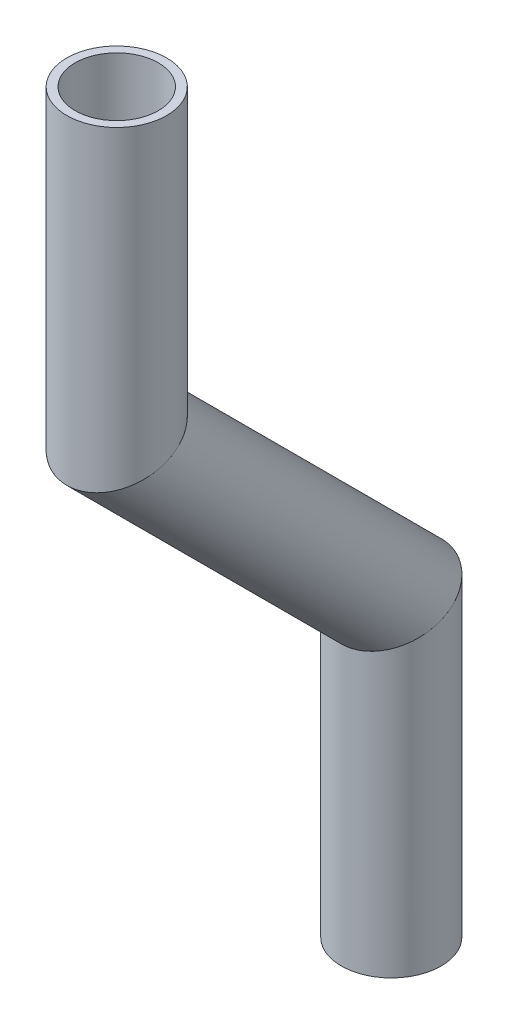
ISO-10303-21;
HEADER;
FILE_DESCRIPTION(('STEP AP214'),'2;1');
FILE_NAME('part.step','',(''),(''),'','','');
FILE_SCHEMA(('AUTOMOTIVE_DESIGN { 1 0 10303 214 1 1 1 1 }'));
ENDSEC;
DATA;
#1=APPLICATION_CONTEXT('core data for automotive mechanical design processes');
#2=APPLICATION_PROTOCOL_DEFINITION('international standard','automotive_design',2000,#1);
#3=PRODUCT_CONTEXT('',#1,'mechanical');
#4=PRODUCT('Part','Part','',(#3));
#5=PRODUCT_RELATED_PRODUCT_CATEGORY('part','',(#4));
#6=PRODUCT_DEFINITION_FORMATION('','',#4);
#7=PRODUCT_DEFINITION_CONTEXT('part definition',#1,'design');
#8=PRODUCT_DEFINITION('design','',#6,#7);
#9=PRODUCT_DEFINITION_SHAPE('','',#8);
#10=(LENGTH_UNIT() NAMED_UNIT(*) SI_UNIT(.MILLI.,.METRE.));
#11=(NAMED_UNIT(*) PLANE_ANGLE_UNIT() SI_UNIT($,.RADIAN.));
#12=(NAMED_UNIT(*) SI_UNIT($,.STERADIAN.) SOLID_ANGLE_UNIT());
#13=UNCERTAINTY_MEASURE_WITH_UNIT(LENGTH_MEASURE(1.E-05),#10,'distance_accuracy_value','');
#14=(GEOMETRIC_REPRESENTATION_CONTEXT(3) GLOBAL_UNCERTAINTY_ASSIGNED_CONTEXT((#13)) GLOBAL_UNIT_ASSIGNED_CONTEXT((#10,
#11,#12)) REPRESENTATION_CONTEXT('',''));
#15=CARTESIAN_POINT('',(0.,0.,0.));
#16=DIRECTION('',(0.,0.,1.));
#17=DIRECTION('',(1.,0.,0.));
#18=AXIS2_PLACEMENT_3D('',#15,#16,#17);
#19=CARTESIAN_POINT('',(0.,-473.44106483783,362.765281468091));
#20=DIRECTION('',(0.,1.,0.));
#21=DIRECTION('',(0.,0.,1.));
#22=AXIS2_PLACEMENT_3D('',#19,#20,#21);
#23=CYLINDRICAL_SURFACE('',#22,5.28319999999999);
#24=CARTESIAN_POINT('',(0.,-435.34106483783,362.765281468092));
#25=DIRECTION('',(0.,-1.,0.));
#26=DIRECTION('',(0.,0.,-1.));
#27=AXIS2_PLACEMENT_3D('',#24,#25,#26);
#28=CIRCLE('',#27,5.28319999999999);
#29=CARTESIAN_POINT('',(0.,-435.34106483783,357.482081468092));
#30=VERTEX_POINT('',#29);
#31=EDGE_CURVE('E68',#30,#30,#28,.T.);
#32=ORIENTED_EDGE('',*,*,#31,.F.);
#33=EDGE_LOOP('',(#32));
#34=FACE_BOUND('',#33,.T.);
#35=CARTESIAN_POINT('',(0.,-473.44106483783,362.765281468091));
#36=DIRECTION('',(0.,-0.923879532511285,-0.382683432365094));
#37=DIRECTION('',(0.,0.382683432365094,-0.923879532511285));
#38=AXIS2_PLACEMENT_3D('',#35,#36,#37);
#39=ELLIPSE('',#38,5.71849447258476,5.28319999999999);
#40=CARTESIAN_POINT('',(0.,-471.2526917451,357.482081468091));
#41=VERTEX_POINT('',#40);
#42=EDGE_CURVE('E64',#41,#41,#39,.T.);
#43=ORIENTED_EDGE('',*,*,#42,.T.);
#44=EDGE_LOOP('',(#43));
#45=FACE_BOUND('',#44,.T.);
#46=ADVANCED_FACE('F60',(#34,#45),#23,.F.);
#47=CARTESIAN_POINT('',(0.,-473.44106483783,362.765281468091));
#48=DIRECTION('',(0.,1.,0.));
#49=DIRECTION('',(0.,0.,1.));
#50=AXIS2_PLACEMENT_3D('',#47,#48,#49);
#51=CYLINDRICAL_SURFACE('',#50,6.35);
#52=CARTESIAN_POINT('',(0.,-435.34106483783,362.765281468092));
#53=DIRECTION('',(0.,-1.,0.));
#54=DIRECTION('',(0.,0.,-1.));
#55=AXIS2_PLACEMENT_3D('',#52,#53,#54);
#56=CIRCLE('',#55,6.35);
#57=CARTESIAN_POINT('',(0.,-435.34106483783,356.415281468092));
#58=VERTEX_POINT('',#57);
#59=EDGE_CURVE('E72',#58,#58,#56,.T.);
#60=ORIENTED_EDGE('',*,*,#59,.T.);
#61=EDGE_LOOP('',(#60));
#62=FACE_BOUND('',#61,.T.);
#63=CARTESIAN_POINT('',(0.,-473.44106483783,362.765281468091));
#64=DIRECTION('',(0.,-0.923879532511285,-0.382683432365094));
#65=DIRECTION('',(0.,0.382683432365094,-0.923879532511285));
#66=AXIS2_PLACEMENT_3D('',#63,#64,#65);
#67=ELLIPSE('',#66,6.8731904718567,6.35);
#68=CARTESIAN_POINT('',(0.,-470.810808716761,356.415281468091));
#69=VERTEX_POINT('',#68);
#70=EDGE_CURVE('E14',#69,#69,#67,.T.);
#71=ORIENTED_EDGE('',*,*,#70,.F.);
#72=EDGE_LOOP('',(#71));
#73=FACE_BOUND('',#72,.T.);
#74=ADVANCED_FACE('F87',(#62,#73),#51,.T.);
#75=CARTESIAN_POINT('',(0.,-435.34106483783,362.765281468092));
#76=DIRECTION('',(0.,-1.,0.));
#77=DIRECTION('',(0.,0.,-1.));
#78=AXIS2_PLACEMENT_3D('',#75,#76,#77);
#79=PLANE('',#78);
#80=ORIENTED_EDGE('',*,*,#31,.T.);
#81=EDGE_LOOP('',(#80));
#82=FACE_BOUND('',#81,.T.);
#83=ORIENTED_EDGE('',*,*,#59,.F.);
#84=EDGE_LOOP('',(#83));
#85=FACE_BOUND('',#84,.T.);
#86=ADVANCED_FACE('F83',(#82,#85),#79,.F.);
#87=CARTESIAN_POINT('',(0.,-473.44106483783,362.765281468091));
#88=DIRECTION('',(0.,-0.923879532511285,-0.382683432365094));
#89=DIRECTION('',(0.,0.382683432365094,-0.923879532511285));
#90=AXIS2_PLACEMENT_3D('',#87,#88,#89);
#91=PLANE('',#90);
#92=ORIENTED_EDGE('',*,*,#42,.F.);
#93=EDGE_LOOP('',(#92));
#94=FACE_BOUND('',#93,.T.);
#95=ORIENTED_EDGE('',*,*,#70,.T.);
#96=EDGE_LOOP('',(#95));
#97=FACE_BOUND('',#96,.T.);
#98=ADVANCED_FACE('F62',(#94,#97),#91,.T.);
#99=CLOSED_SHELL('',(#46,#74,#86,#98));
#100=MANIFOLD_SOLID_BREP('B2',#99);
#101=CARTESIAN_POINT('',(0.,-508.351753076972,327.854593228949));
#102=DIRECTION('',(0.,0.707106781186545,0.70710678118655));
#103=DIRECTION('',(0.,-0.70710678118655,0.707106781186545));
#104=AXIS2_PLACEMENT_3D('',#101,#102,#103);
#105=CYLINDRICAL_SURFACE('',#104,5.28319999999999);
#106=CARTESIAN_POINT('',(0.,-508.351753076972,327.854593228949));
#107=DIRECTION('',(0.,-0.923879532511285,-0.382683432365094));
#108=DIRECTION('',(0.,-0.382683432365094,0.923879532511285));
#109=AXIS2_PLACEMENT_3D('',#106,#107,#108);
#110=ELLIPSE('',#109,5.71849447258476,5.28319999999999);
#111=CARTESIAN_POINT('',(0.,-510.540126169702,333.137793228949));
#112=VERTEX_POINT('',#111);
#113=EDGE_CURVE('E167',#112,#112,#110,.T.);
#114=ORIENTED_EDGE('',*,*,#113,.T.);
#115=EDGE_LOOP('',(#114));
#116=FACE_BOUND('',#115,.T.);
#117=CARTESIAN_POINT('',(0.,-473.44106483783,362.765281468091));
#118=DIRECTION('',(0.,0.923879532511285,0.382683432365094));
#119=DIRECTION('',(0.,-0.382683432365094,0.923879532511285));
#120=AXIS2_PLACEMENT_3D('',#117,#118,#119);
#121=ELLIPSE('',#120,5.71849447258476,5.28319999999999);
#122=CARTESIAN_POINT('',(0.,-475.629437930559,368.048481468091));
#123=VERTEX_POINT('',#122);
#124=EDGE_CURVE('E157',#123,#123,#121,.T.);
#125=ORIENTED_EDGE('',*,*,#124,.T.);
#126=EDGE_LOOP('',(#125));
#127=FACE_BOUND('',#126,.T.);
#128=ADVANCED_FACE('F153',(#116,#127),#105,.F.);
#129=CARTESIAN_POINT('',(0.,-508.351753076972,327.854593228949));
#130=DIRECTION('',(0.,0.707106781186545,0.70710678118655));
#131=DIRECTION('',(0.,-0.70710678118655,0.707106781186545));
#132=AXIS2_PLACEMENT_3D('',#129,#130,#131);
#133=CYLINDRICAL_SURFACE('',#132,6.35);
#134=CARTESIAN_POINT('',(0.,-508.351753076972,327.854593228949));
#135=DIRECTION('',(0.,-0.923879532511285,-0.382683432365094));
#136=DIRECTION('',(0.,-0.382683432365094,0.923879532511285));
#137=AXIS2_PLACEMENT_3D('',#134,#135,#136);
#138=ELLIPSE('',#137,6.8731904718567,6.35);
#139=CARTESIAN_POINT('',(0.,-510.982009198041,334.204593228949));
#140=VERTEX_POINT('',#139);
#141=EDGE_CURVE('E161',#140,#140,#138,.T.);
#142=ORIENTED_EDGE('',*,*,#141,.F.);
#143=EDGE_LOOP('',(#142));
#144=FACE_BOUND('',#143,.T.);
#145=CARTESIAN_POINT('',(0.,-473.44106483783,362.765281468091));
#146=DIRECTION('',(0.,0.923879532511285,0.382683432365094));
#147=DIRECTION('',(0.,-0.382683432365094,0.923879532511285));
#148=AXIS2_PLACEMENT_3D('',#145,#146,#147);
#149=ELLIPSE('',#148,6.8731904718567,6.35);
#150=CARTESIAN_POINT('',(0.,-476.071320958899,369.115281468091));
#151=VERTEX_POINT('',#150);
#152=EDGE_CURVE('E59',#151,#151,#149,.T.);
#153=ORIENTED_EDGE('',*,*,#152,.F.);
#154=EDGE_LOOP('',(#153));
#155=FACE_BOUND('',#154,.T.);
#156=ADVANCED_FACE('F180',(#144,#155),#133,.T.);
#157=CARTESIAN_POINT('',(0.,-508.351753076972,327.854593228949));
#158=DIRECTION('',(0.,-0.923879532511285,-0.382683432365094));
#159=DIRECTION('',(0.,0.382683432365094,-0.923879532511285));
#160=AXIS2_PLACEMENT_3D('',#157,#158,#159);
#161=PLANE('',#160);
#162=ORIENTED_EDGE('',*,*,#113,.F.);
#163=EDGE_LOOP('',(#162));
#164=FACE_BOUND('',#163,.T.);
#165=ORIENTED_EDGE('',*,*,#141,.T.);
#166=EDGE_LOOP('',(#165));
#167=FACE_BOUND('',#166,.T.);
#168=ADVANCED_FACE('F176',(#164,#167),#161,.T.);
#169=CARTESIAN_POINT('',(0.,-473.44106483783,362.765281468091));
#170=DIRECTION('',(0.,0.923879532511285,0.382683432365094));
#171=DIRECTION('',(0.,-0.382683432365094,0.923879532511285));
#172=AXIS2_PLACEMENT_3D('',#169,#170,#171);
#173=PLANE('',#172);
#174=ORIENTED_EDGE('',*,*,#124,.F.);
#175=EDGE_LOOP('',(#174));
#176=FACE_BOUND('',#175,.T.);
#177=ORIENTED_EDGE('',*,*,#152,.T.);
#178=EDGE_LOOP('',(#177));
#179=FACE_BOUND('',#178,.T.);
#180=ADVANCED_FACE('F155',(#176,#179),#173,.T.);
#181=CLOSED_SHELL('',(#128,#156,#168,#180));
#182=MANIFOLD_SOLID_BREP('B9',#181);
#183=CARTESIAN_POINT('',(0.,-546.451753076974,327.854593228946));
#184=DIRECTION('',(0.,1.,0.));
#185=DIRECTION('',(0.,0.,1.));
#186=AXIS2_PLACEMENT_3D('',#183,#184,#185);
#187=CYLINDRICAL_SURFACE('',#186,5.28319999999999);
#188=CARTESIAN_POINT('',(0.,-546.451753076974,327.854593228946));
#189=DIRECTION('',(0.,-1.,0.));
#190=DIRECTION('',(0.,0.,-1.));
#191=AXIS2_PLACEMENT_3D('',#188,#189,#190);
#192=CIRCLE('',#191,5.28319999999999);
#193=CARTESIAN_POINT('',(0.,-546.451753076974,322.571393228946));
#194=VERTEX_POINT('',#193);
#195=EDGE_CURVE('E249',#194,#194,#192,.T.);
#196=ORIENTED_EDGE('',*,*,#195,.T.);
#197=EDGE_LOOP('',(#196));
#198=FACE_BOUND('',#197,.T.);
#199=CARTESIAN_POINT('',(0.,-508.351753076971,327.854593228946));
#200=DIRECTION('',(0.,0.923879532511285,0.382683432365094));
#201=DIRECTION('',(0.,0.382683432365094,-0.923879532511285));
#202=AXIS2_PLACEMENT_3D('',#199,#200,#201);
#203=ELLIPSE('',#202,5.71849447258477,5.28319999999999);
#204=CARTESIAN_POINT('',(0.,-506.163379984242,322.571393228946));
#205=VERTEX_POINT('',#204);
#206=EDGE_CURVE('E239',#205,#205,#203,.T.);
#207=ORIENTED_EDGE('',*,*,#206,.T.);
#208=EDGE_LOOP('',(#207));
#209=FACE_BOUND('',#208,.T.);
#210=ADVANCED_FACE('F235',(#198,#209),#187,.F.);
#211=CARTESIAN_POINT('',(0.,-546.451753076974,327.854593228946));
#212=DIRECTION('',(0.,1.,0.));
#213=DIRECTION('',(0.,0.,1.));
#214=AXIS2_PLACEMENT_3D('',#211,#212,#213);
#215=CYLINDRICAL_SURFACE('',#214,6.35);
#216=CARTESIAN_POINT('',(0.,-546.451753076974,327.854593228946));
#217=DIRECTION('',(0.,-1.,0.));
#218=DIRECTION('',(0.,0.,-1.));
#219=AXIS2_PLACEMENT_3D('',#216,#217,#218);
#220=CIRCLE('',#219,6.35);
#221=CARTESIAN_POINT('',(0.,-546.451753076974,321.504593228946));
#222=VERTEX_POINT('',#221);
#223=EDGE_CURVE('E243',#222,#222,#220,.T.);
#224=ORIENTED_EDGE('',*,*,#223,.F.);
#225=EDGE_LOOP('',(#224));
#226=FACE_BOUND('',#225,.T.);
#227=CARTESIAN_POINT('',(0.,-508.351753076971,327.854593228946));
#228=DIRECTION('',(0.,0.923879532511285,0.382683432365094));
#229=DIRECTION('',(0.,0.382683432365094,-0.923879532511285));
#230=AXIS2_PLACEMENT_3D('',#227,#228,#229);
#231=ELLIPSE('',#230,6.87319047185671,6.35);
#232=CARTESIAN_POINT('',(0.,-505.721496955902,321.504593228946));
#233=VERTEX_POINT('',#232);
#234=EDGE_CURVE('E152',#233,#233,#231,.T.);
#235=ORIENTED_EDGE('',*,*,#234,.F.);
#236=EDGE_LOOP('',(#235));
#237=FACE_BOUND('',#236,.T.);
#238=ADVANCED_FACE('F262',(#226,#237),#215,.T.);
#239=CARTESIAN_POINT('',(0.,-546.451753076974,327.854593228946));
#240=DIRECTION('',(0.,-1.,0.));
#241=DIRECTION('',(0.,0.,-1.));
#242=AXIS2_PLACEMENT_3D('',#239,#240,#241);
#243=PLANE('',#242);
#244=ORIENTED_EDGE('',*,*,#195,.F.);
#245=EDGE_LOOP('',(#244));
#246=FACE_BOUND('',#245,.T.);
#247=ORIENTED_EDGE('',*,*,#223,.T.);
#248=EDGE_LOOP('',(#247));
#249=FACE_BOUND('',#248,.T.);
#250=ADVANCED_FACE('F258',(#246,#249),#243,.T.);
#251=CARTESIAN_POINT('',(0.,-508.351753076972,327.854593228949));
#252=DIRECTION('',(0.,0.923879532511285,0.382683432365094));
#253=DIRECTION('',(0.,-0.382683432365094,0.923879532511285));
#254=AXIS2_PLACEMENT_3D('',#251,#252,#253);
#255=PLANE('',#254);
#256=ORIENTED_EDGE('',*,*,#206,.F.);
#257=EDGE_LOOP('',(#256));
#258=FACE_BOUND('',#257,.T.);
#259=ORIENTED_EDGE('',*,*,#234,.T.);
#260=EDGE_LOOP('',(#259));
#261=FACE_BOUND('',#260,.T.);
#262=ADVANCED_FACE('F237',(#258,#261),#255,.T.);
#263=CLOSED_SHELL('',(#210,#238,#250,#262));
#264=MANIFOLD_SOLID_BREP('B54',#263);
#265=ADVANCED_BREP_SHAPE_REPRESENTATION('',(#18,#100,#182,#264),#14);
#266=SHAPE_DEFINITION_REPRESENTATION(#9,#265);
ENDSEC;
END-ISO-10303-21;
